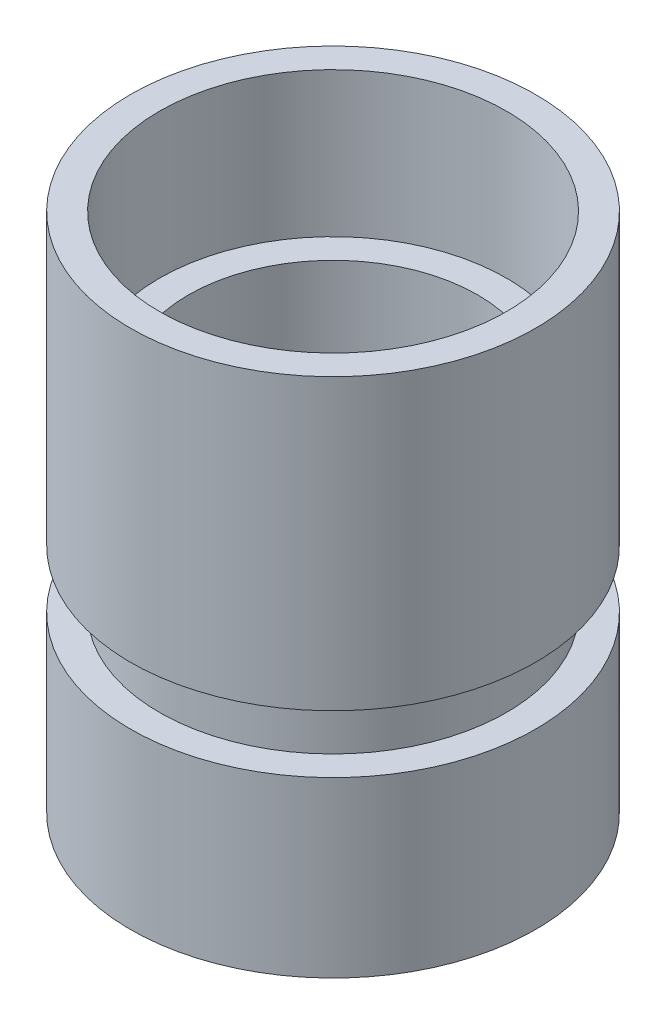
ISO-10303-21;
HEADER;
FILE_DESCRIPTION(('STEP AP214'),'2;1');
FILE_NAME('part.step','',(''),(''),'','','');
FILE_SCHEMA(('AUTOMOTIVE_DESIGN { 1 0 10303 214 1 1 1 1 }'));
ENDSEC;
DATA;
#1=APPLICATION_CONTEXT('core data for automotive mechanical design processes');
#2=APPLICATION_PROTOCOL_DEFINITION('international standard','automotive_design',2000,#1);
#3=PRODUCT_CONTEXT('',#1,'mechanical');
#4=PRODUCT('Part','Part','',(#3));
#5=PRODUCT_RELATED_PRODUCT_CATEGORY('part','',(#4));
#6=PRODUCT_DEFINITION_FORMATION('','',#4);
#7=PRODUCT_DEFINITION_CONTEXT('part definition',#1,'design');
#8=PRODUCT_DEFINITION('design','',#6,#7);
#9=PRODUCT_DEFINITION_SHAPE('','',#8);
#10=(LENGTH_UNIT() NAMED_UNIT(*) SI_UNIT(.MILLI.,.METRE.));
#11=(NAMED_UNIT(*) PLANE_ANGLE_UNIT() SI_UNIT($,.RADIAN.));
#12=(NAMED_UNIT(*) SI_UNIT($,.STERADIAN.) SOLID_ANGLE_UNIT());
#13=UNCERTAINTY_MEASURE_WITH_UNIT(LENGTH_MEASURE(1.E-05),#10,'distance_accuracy_value','');
#14=(GEOMETRIC_REPRESENTATION_CONTEXT(3) GLOBAL_UNCERTAINTY_ASSIGNED_CONTEXT((#13)) GLOBAL_UNIT_ASSIGNED_CONTEXT((#10,
#11,#12)) REPRESENTATION_CONTEXT('',''));
#15=CARTESIAN_POINT('',(0.,0.,0.));
#16=DIRECTION('',(0.,0.,1.));
#17=DIRECTION('',(1.,0.,0.));
#18=AXIS2_PLACEMENT_3D('',#15,#16,#17);
#19=CARTESIAN_POINT('',(0.,1.,0.));
#20=DIRECTION('',(0.,-1.,0.));
#21=DIRECTION('',(1.,0.,0.));
#22=AXIS2_PLACEMENT_3D('',#19,#20,#21);
#23=PLANE('',#22);
#24=CARTESIAN_POINT('',(0.,1.,0.));
#25=DIRECTION('',(0.,1.,0.));
#26=DIRECTION('',(0.,0.,1.));
#27=AXIS2_PLACEMENT_3D('',#24,#25,#26);
#28=CIRCLE('',#27,5.);
#29=CARTESIAN_POINT('',(0.,1.,5.));
#30=VERTEX_POINT('',#29);
#31=EDGE_CURVE('E18',#30,#30,#28,.F.);
#32=ORIENTED_EDGE('',*,*,#31,.T.);
#33=EDGE_LOOP('',(#32));
#34=FACE_BOUND('',#33,.T.);
#35=CARTESIAN_POINT('',(0.,1.,0.));
#36=DIRECTION('',(0.,1.,0.));
#37=DIRECTION('',(-1.,0.,0.));
#38=AXIS2_PLACEMENT_3D('',#35,#36,#37);
#39=CIRCLE('',#38,3.);
#40=CARTESIAN_POINT('',(-3.,1.,0.));
#41=VERTEX_POINT('',#40);
#42=EDGE_CURVE('E58',#41,#41,#39,.T.);
#43=ORIENTED_EDGE('',*,*,#42,.T.);
#44=EDGE_LOOP('',(#43));
#45=FACE_BOUND('',#44,.T.);
#46=ADVANCED_FACE('F15',(#34,#45),#23,.T.);
#47=CARTESIAN_POINT('',(0.,0.,0.));
#48=DIRECTION('',(0.,1.,0.));
#49=DIRECTION('',(0.,0.,1.));
#50=AXIS2_PLACEMENT_3D('',#47,#48,#49);
#51=CYLINDRICAL_SURFACE('',#50,5.);
#52=ORIENTED_EDGE('',*,*,#31,.F.);
#53=EDGE_LOOP('',(#52));
#54=FACE_BOUND('',#53,.T.);
#55=CARTESIAN_POINT('',(0.,0.,0.));
#56=DIRECTION('',(0.,1.,0.));
#57=DIRECTION('',(0.,0.,1.));
#58=AXIS2_PLACEMENT_3D('',#55,#56,#57);
#59=CIRCLE('',#58,5.);
#60=CARTESIAN_POINT('',(0.,0.,5.));
#61=VERTEX_POINT('',#60);
#62=EDGE_CURVE('E56',#61,#61,#59,.T.);
#63=ORIENTED_EDGE('',*,*,#62,.F.);
#64=EDGE_LOOP('',(#63));
#65=FACE_BOUND('',#64,.T.);
#66=ADVANCED_FACE('F66',(#54,#65),#51,.F.);
#67=CARTESIAN_POINT('',(0.,1.,0.));
#68=DIRECTION('',(0.,1.,0.));
#69=DIRECTION('',(-1.,0.,0.));
#70=AXIS2_PLACEMENT_3D('',#67,#68,#69);
#71=CYLINDRICAL_SURFACE('',#70,3.);
#72=ORIENTED_EDGE('',*,*,#42,.F.);
#73=EDGE_LOOP('',(#72));
#74=FACE_BOUND('',#73,.T.);
#75=CARTESIAN_POINT('',(0.,2.,0.));
#76=DIRECTION('',(0.,1.,0.));
#77=DIRECTION('',(-1.,0.,0.));
#78=AXIS2_PLACEMENT_3D('',#75,#76,#77);
#79=CIRCLE('',#78,3.);
#80=CARTESIAN_POINT('',(-3.,2.,0.));
#81=VERTEX_POINT('',#80);
#82=EDGE_CURVE('E53',#81,#81,#79,.F.);
#83=ORIENTED_EDGE('',*,*,#82,.F.);
#84=EDGE_LOOP('',(#83));
#85=FACE_BOUND('',#84,.T.);
#86=ADVANCED_FACE('F69',(#74,#85),#71,.F.);
#87=CARTESIAN_POINT('',(-7.,0.,0.));
#88=DIRECTION('',(0.,-1.,0.));
#89=DIRECTION('',(1.,0.,0.));
#90=AXIS2_PLACEMENT_3D('',#87,#88,#89);
#91=PLANE('',#90);
#92=CARTESIAN_POINT('',(0.,0.,0.));
#93=DIRECTION('',(0.,1.,0.));
#94=DIRECTION('',(-1.,0.,0.));
#95=AXIS2_PLACEMENT_3D('',#92,#93,#94);
#96=CIRCLE('',#95,7.);
#97=CARTESIAN_POINT('',(-7.,0.,0.));
#98=VERTEX_POINT('',#97);
#99=EDGE_CURVE('E50',#98,#98,#96,.T.);
#100=ORIENTED_EDGE('',*,*,#99,.F.);
#101=EDGE_LOOP('',(#100));
#102=FACE_BOUND('',#101,.T.);
#103=ORIENTED_EDGE('',*,*,#62,.T.);
#104=EDGE_LOOP('',(#103));
#105=FACE_BOUND('',#104,.T.);
#106=ADVANCED_FACE('F72',(#102,#105),#91,.T.);
#107=CARTESIAN_POINT('',(-3.,2.,0.));
#108=DIRECTION('',(0.,1.,0.));
#109=DIRECTION('',(-1.,0.,0.));
#110=AXIS2_PLACEMENT_3D('',#107,#108,#109);
#111=PLANE('',#110);
#112=CARTESIAN_POINT('',(0.,2.,0.));
#113=DIRECTION('',(0.,1.,0.));
#114=DIRECTION('',(-1.,0.,0.));
#115=AXIS2_PLACEMENT_3D('',#112,#113,#114);
#116=CIRCLE('',#115,5.);
#117=CARTESIAN_POINT('',(-5.,2.,0.));
#118=VERTEX_POINT('',#117);
#119=EDGE_CURVE('E47',#118,#118,#116,.T.);
#120=ORIENTED_EDGE('',*,*,#119,.T.);
#121=EDGE_LOOP('',(#120));
#122=FACE_BOUND('',#121,.T.);
#123=ORIENTED_EDGE('',*,*,#82,.T.);
#124=EDGE_LOOP('',(#123));
#125=FACE_BOUND('',#124,.T.);
#126=ADVANCED_FACE('F74',(#122,#125),#111,.T.);
#127=CARTESIAN_POINT('',(0.,3.,0.));
#128=DIRECTION('',(0.,1.,0.));
#129=DIRECTION('',(-1.,0.,0.));
#130=AXIS2_PLACEMENT_3D('',#127,#128,#129);
#131=CYLINDRICAL_SURFACE('',#130,7.);
#132=ORIENTED_EDGE('',*,*,#99,.T.);
#133=EDGE_LOOP('',(#132));
#134=FACE_BOUND('',#133,.T.);
#135=CARTESIAN_POINT('',(0.,6.,0.));
#136=DIRECTION('',(0.,1.,0.));
#137=DIRECTION('',(-1.,0.,0.));
#138=AXIS2_PLACEMENT_3D('',#135,#136,#137);
#139=CIRCLE('',#138,7.);
#140=CARTESIAN_POINT('',(-7.,6.,0.));
#141=VERTEX_POINT('',#140);
#142=EDGE_CURVE('E44',#141,#141,#139,.T.);
#143=ORIENTED_EDGE('',*,*,#142,.F.);
#144=EDGE_LOOP('',(#143));
#145=FACE_BOUND('',#144,.T.);
#146=ADVANCED_FACE('F82',(#134,#145),#131,.T.);
#147=CARTESIAN_POINT('',(0.,7.5,0.));
#148=DIRECTION('',(0.,1.,0.));
#149=DIRECTION('',(-1.,0.,0.));
#150=AXIS2_PLACEMENT_3D('',#147,#148,#149);
#151=CYLINDRICAL_SURFACE('',#150,5.);
#152=ORIENTED_EDGE('',*,*,#119,.F.);
#153=EDGE_LOOP('',(#152));
#154=FACE_BOUND('',#153,.T.);
#155=CARTESIAN_POINT('',(0.,13.,0.));
#156=DIRECTION('',(0.,1.,0.));
#157=DIRECTION('',(-1.,0.,0.));
#158=AXIS2_PLACEMENT_3D('',#155,#156,#157);
#159=CIRCLE('',#158,5.);
#160=CARTESIAN_POINT('',(-5.,13.,0.));
#161=VERTEX_POINT('',#160);
#162=EDGE_CURVE('E41',#161,#161,#159,.F.);
#163=ORIENTED_EDGE('',*,*,#162,.F.);
#164=EDGE_LOOP('',(#163));
#165=FACE_BOUND('',#164,.T.);
#166=ADVANCED_FACE('F118',(#154,#165),#151,.F.);
#167=CARTESIAN_POINT('',(-6.,6.,0.));
#168=DIRECTION('',(0.,1.,0.));
#169=DIRECTION('',(-1.,0.,0.));
#170=AXIS2_PLACEMENT_3D('',#167,#168,#169);
#171=PLANE('',#170);
#172=ORIENTED_EDGE('',*,*,#142,.T.);
#173=EDGE_LOOP('',(#172));
#174=FACE_BOUND('',#173,.T.);
#175=CARTESIAN_POINT('',(0.,6.,0.));
#176=DIRECTION('',(0.,1.,0.));
#177=DIRECTION('',(-1.,0.,0.));
#178=AXIS2_PLACEMENT_3D('',#175,#176,#177);
#179=CIRCLE('',#178,6.);
#180=CARTESIAN_POINT('',(-6.,6.,0.));
#181=VERTEX_POINT('',#180);
#182=EDGE_CURVE('E38',#181,#181,#179,.T.);
#183=ORIENTED_EDGE('',*,*,#182,.F.);
#184=EDGE_LOOP('',(#183));
#185=FACE_BOUND('',#184,.T.);
#186=ADVANCED_FACE('F114',(#174,#185),#171,.T.);
#187=CARTESIAN_POINT('',(-5.,13.,0.));
#188=DIRECTION('',(0.,1.,0.));
#189=DIRECTION('',(-1.,0.,0.));
#190=AXIS2_PLACEMENT_3D('',#187,#188,#189);
#191=PLANE('',#190);
#192=CARTESIAN_POINT('',(0.,13.,0.));
#193=DIRECTION('',(0.,1.,0.));
#194=DIRECTION('',(-1.,0.,0.));
#195=AXIS2_PLACEMENT_3D('',#192,#193,#194);
#196=CIRCLE('',#195,6.);
#197=CARTESIAN_POINT('',(-6.,13.,0.));
#198=VERTEX_POINT('',#197);
#199=EDGE_CURVE('E35',#198,#198,#196,.T.);
#200=ORIENTED_EDGE('',*,*,#199,.T.);
#201=EDGE_LOOP('',(#200));
#202=FACE_BOUND('',#201,.T.);
#203=ORIENTED_EDGE('',*,*,#162,.T.);
#204=EDGE_LOOP('',(#203));
#205=FACE_BOUND('',#204,.T.);
#206=ADVANCED_FACE('F110',(#202,#205),#191,.T.);
#207=CARTESIAN_POINT('',(0.,7.,0.));
#208=DIRECTION('',(0.,1.,0.));
#209=DIRECTION('',(-1.,0.,0.));
#210=AXIS2_PLACEMENT_3D('',#207,#208,#209);
#211=CYLINDRICAL_SURFACE('',#210,6.);
#212=ORIENTED_EDGE('',*,*,#182,.T.);
#213=EDGE_LOOP('',(#212));
#214=FACE_BOUND('',#213,.T.);
#215=CARTESIAN_POINT('',(0.,8.,0.));
#216=DIRECTION('',(0.,1.,0.));
#217=DIRECTION('',(-1.,0.,0.));
#218=AXIS2_PLACEMENT_3D('',#215,#216,#217);
#219=CIRCLE('',#218,6.);
#220=CARTESIAN_POINT('',(-6.,8.,0.));
#221=VERTEX_POINT('',#220);
#222=EDGE_CURVE('E32',#221,#221,#219,.T.);
#223=ORIENTED_EDGE('',*,*,#222,.F.);
#224=EDGE_LOOP('',(#223));
#225=FACE_BOUND('',#224,.T.);
#226=ADVANCED_FACE('F106',(#214,#225),#211,.T.);
#227=CARTESIAN_POINT('',(0.,15.5,0.));
#228=DIRECTION('',(0.,1.,0.));
#229=DIRECTION('',(-1.,0.,0.));
#230=AXIS2_PLACEMENT_3D('',#227,#228,#229);
#231=CYLINDRICAL_SURFACE('',#230,6.);
#232=ORIENTED_EDGE('',*,*,#199,.F.);
#233=EDGE_LOOP('',(#232));
#234=FACE_BOUND('',#233,.T.);
#235=CARTESIAN_POINT('',(0.,18.,0.));
#236=DIRECTION('',(0.,1.,0.));
#237=DIRECTION('',(-1.,0.,0.));
#238=AXIS2_PLACEMENT_3D('',#235,#236,#237);
#239=CIRCLE('',#238,6.);
#240=CARTESIAN_POINT('',(-6.,18.,0.));
#241=VERTEX_POINT('',#240);
#242=EDGE_CURVE('E27',#241,#241,#239,.F.);
#243=ORIENTED_EDGE('',*,*,#242,.F.);
#244=EDGE_LOOP('',(#243));
#245=FACE_BOUND('',#244,.T.);
#246=ADVANCED_FACE('F102',(#234,#245),#231,.F.);
#247=CARTESIAN_POINT('',(-7.,8.,0.));
#248=DIRECTION('',(0.,-1.,0.));
#249=DIRECTION('',(1.,0.,0.));
#250=AXIS2_PLACEMENT_3D('',#247,#248,#249);
#251=PLANE('',#250);
#252=CARTESIAN_POINT('',(0.,8.,0.));
#253=DIRECTION('',(0.,1.,0.));
#254=DIRECTION('',(-1.,0.,0.));
#255=AXIS2_PLACEMENT_3D('',#252,#253,#254);
#256=CIRCLE('',#255,7.);
#257=CARTESIAN_POINT('',(-7.,8.,0.));
#258=VERTEX_POINT('',#257);
#259=EDGE_CURVE('E22',#258,#258,#256,.T.);
#260=ORIENTED_EDGE('',*,*,#259,.F.);
#261=EDGE_LOOP('',(#260));
#262=FACE_BOUND('',#261,.T.);
#263=ORIENTED_EDGE('',*,*,#222,.T.);
#264=EDGE_LOOP('',(#263));
#265=FACE_BOUND('',#264,.T.);
#266=ADVANCED_FACE('F95',(#262,#265),#251,.T.);
#267=CARTESIAN_POINT('',(-6.,18.,0.));
#268=DIRECTION('',(0.,1.,0.));
#269=DIRECTION('',(-1.,0.,0.));
#270=AXIS2_PLACEMENT_3D('',#267,#268,#269);
#271=PLANE('',#270);
#272=CARTESIAN_POINT('',(0.,18.,0.));
#273=DIRECTION('',(0.,1.,0.));
#274=DIRECTION('',(-1.,0.,0.));
#275=AXIS2_PLACEMENT_3D('',#272,#273,#274);
#276=CIRCLE('',#275,7.);
#277=CARTESIAN_POINT('',(-7.,18.,0.));
#278=VERTEX_POINT('',#277);
#279=EDGE_CURVE('E10',#278,#278,#276,.F.);
#280=ORIENTED_EDGE('',*,*,#279,.F.);
#281=EDGE_LOOP('',(#280));
#282=FACE_BOUND('',#281,.T.);
#283=ORIENTED_EDGE('',*,*,#242,.T.);
#284=EDGE_LOOP('',(#283));
#285=FACE_BOUND('',#284,.T.);
#286=ADVANCED_FACE('F90',(#282,#285),#271,.T.);
#287=CARTESIAN_POINT('',(0.,13.,0.));
#288=DIRECTION('',(0.,1.,0.));
#289=DIRECTION('',(-1.,0.,0.));
#290=AXIS2_PLACEMENT_3D('',#287,#288,#289);
#291=CYLINDRICAL_SURFACE('',#290,7.);
#292=ORIENTED_EDGE('',*,*,#279,.T.);
#293=EDGE_LOOP('',(#292));
#294=FACE_BOUND('',#293,.T.);
#295=ORIENTED_EDGE('',*,*,#259,.T.);
#296=EDGE_LOOP('',(#295));
#297=FACE_BOUND('',#296,.T.);
#298=ADVANCED_FACE('F88',(#294,#297),#291,.T.);
#299=CLOSED_SHELL('',(#46,#66,#86,#106,#126,#146,#166,#186,#206,#226,#246,#266,#286,#298));
#300=MANIFOLD_SOLID_BREP('B1',#299);
#301=ADVANCED_BREP_SHAPE_REPRESENTATION('',(#18,#300),#14);
#302=SHAPE_DEFINITION_REPRESENTATION(#9,#301);
ENDSEC;
END-ISO-10303-21;
